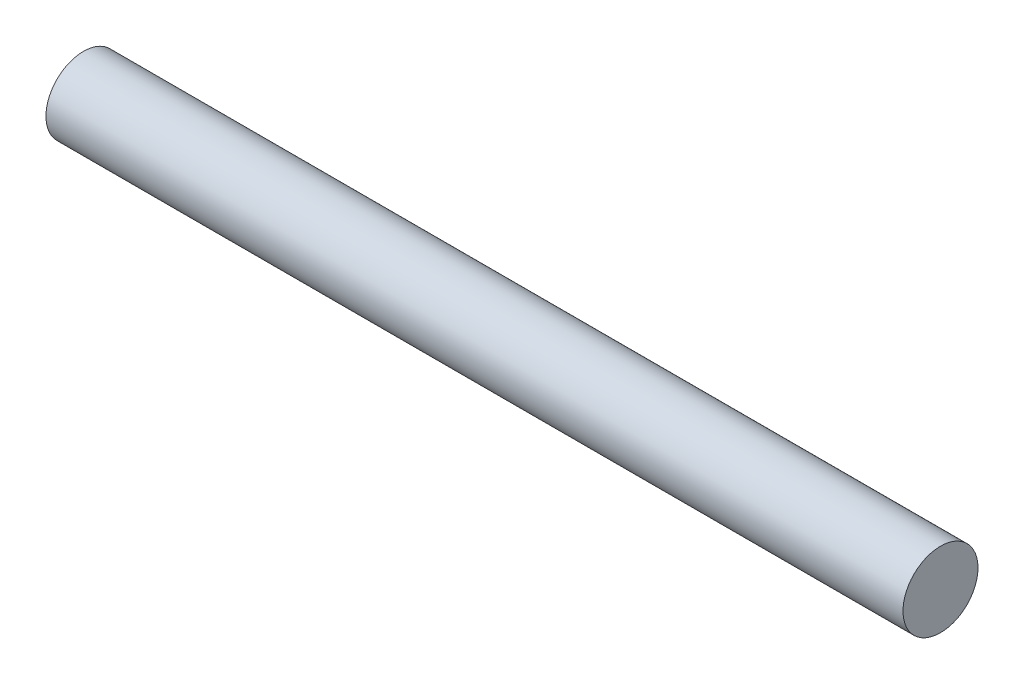
ISO-10303-21;
HEADER;
FILE_DESCRIPTION(('STEP AP214'),'2;1');
FILE_NAME('part.step','',(''),(''),'','','');
FILE_SCHEMA(('AUTOMOTIVE_DESIGN { 1 0 10303 214 1 1 1 1 }'));
ENDSEC;
DATA;
#1=APPLICATION_CONTEXT('core data for automotive mechanical design processes');
#2=APPLICATION_PROTOCOL_DEFINITION('international standard','automotive_design',2000,#1);
#3=PRODUCT_CONTEXT('',#1,'mechanical');
#4=PRODUCT('Part','Part','',(#3));
#5=PRODUCT_RELATED_PRODUCT_CATEGORY('part','',(#4));
#6=PRODUCT_DEFINITION_FORMATION('','',#4);
#7=PRODUCT_DEFINITION_CONTEXT('part definition',#1,'design');
#8=PRODUCT_DEFINITION('design','',#6,#7);
#9=PRODUCT_DEFINITION_SHAPE('','',#8);
#10=(LENGTH_UNIT() NAMED_UNIT(*) SI_UNIT(.MILLI.,.METRE.));
#11=(NAMED_UNIT(*) PLANE_ANGLE_UNIT() SI_UNIT($,.RADIAN.));
#12=(NAMED_UNIT(*) SI_UNIT($,.STERADIAN.) SOLID_ANGLE_UNIT());
#13=UNCERTAINTY_MEASURE_WITH_UNIT(LENGTH_MEASURE(1.E-05),#10,'distance_accuracy_value','');
#14=(GEOMETRIC_REPRESENTATION_CONTEXT(3) GLOBAL_UNCERTAINTY_ASSIGNED_CONTEXT((#13)) GLOBAL_UNIT_ASSIGNED_CONTEXT((#10,
#11,#12)) REPRESENTATION_CONTEXT('',''));
#15=CARTESIAN_POINT('',(0.,0.,0.));
#16=DIRECTION('',(0.,0.,1.));
#17=DIRECTION('',(1.,0.,0.));
#18=AXIS2_PLACEMENT_3D('',#15,#16,#17);
#19=CARTESIAN_POINT('',(68.55,0.,0.));
#20=DIRECTION('',(-1.,0.,0.));
#21=DIRECTION('',(0.,0.,1.));
#22=AXIS2_PLACEMENT_3D('',#19,#20,#21);
#23=CYLINDRICAL_SURFACE('',#22,3.);
#24=CARTESIAN_POINT('',(68.55,0.,0.));
#25=DIRECTION('',(1.,0.,0.));
#26=DIRECTION('',(0.,0.,-1.));
#27=AXIS2_PLACEMENT_3D('',#24,#25,#26);
#28=CIRCLE('',#27,3.);
#29=CARTESIAN_POINT('',(68.55,0.,-3.));
#30=VERTEX_POINT('',#29);
#31=EDGE_CURVE('E10',#30,#30,#28,.T.);
#32=ORIENTED_EDGE('',*,*,#31,.F.);
#33=EDGE_LOOP('',(#32));
#34=FACE_BOUND('',#33,.T.);
#35=CARTESIAN_POINT('',(0.,0.,0.));
#36=DIRECTION('',(1.,0.,0.));
#37=DIRECTION('',(0.,0.,-1.));
#38=AXIS2_PLACEMENT_3D('',#35,#36,#37);
#39=CIRCLE('',#38,3.);
#40=CARTESIAN_POINT('',(0.,0.,-3.));
#41=VERTEX_POINT('',#40);
#42=EDGE_CURVE('E32',#41,#41,#39,.T.);
#43=ORIENTED_EDGE('',*,*,#42,.T.);
#44=EDGE_LOOP('',(#43));
#45=FACE_BOUND('',#44,.T.);
#46=ADVANCED_FACE('F29',(#34,#45),#23,.T.);
#47=CARTESIAN_POINT('',(68.55,0.,0.));
#48=DIRECTION('',(1.,0.,0.));
#49=DIRECTION('',(0.,0.,-1.));
#50=AXIS2_PLACEMENT_3D('',#47,#48,#49);
#51=PLANE('',#50);
#52=ORIENTED_EDGE('',*,*,#31,.T.);
#53=EDGE_LOOP('',(#52));
#54=FACE_BOUND('',#53,.T.);
#55=ADVANCED_FACE('F44',(#54),#51,.T.);
#56=CARTESIAN_POINT('',(0.,0.,0.));
#57=DIRECTION('',(1.,0.,0.));
#58=DIRECTION('',(0.,0.,-1.));
#59=AXIS2_PLACEMENT_3D('',#56,#57,#58);
#60=PLANE('',#59);
#61=ORIENTED_EDGE('',*,*,#42,.F.);
#62=EDGE_LOOP('',(#61));
#63=FACE_BOUND('',#62,.T.);
#64=ADVANCED_FACE('F42',(#63),#60,.F.);
#65=CLOSED_SHELL('',(#46,#55,#64));
#66=MANIFOLD_SOLID_BREP('B2',#65);
#67=ADVANCED_BREP_SHAPE_REPRESENTATION('',(#18,#66),#14);
#68=SHAPE_DEFINITION_REPRESENTATION(#9,#67);
ENDSEC;
END-ISO-10303-21;
